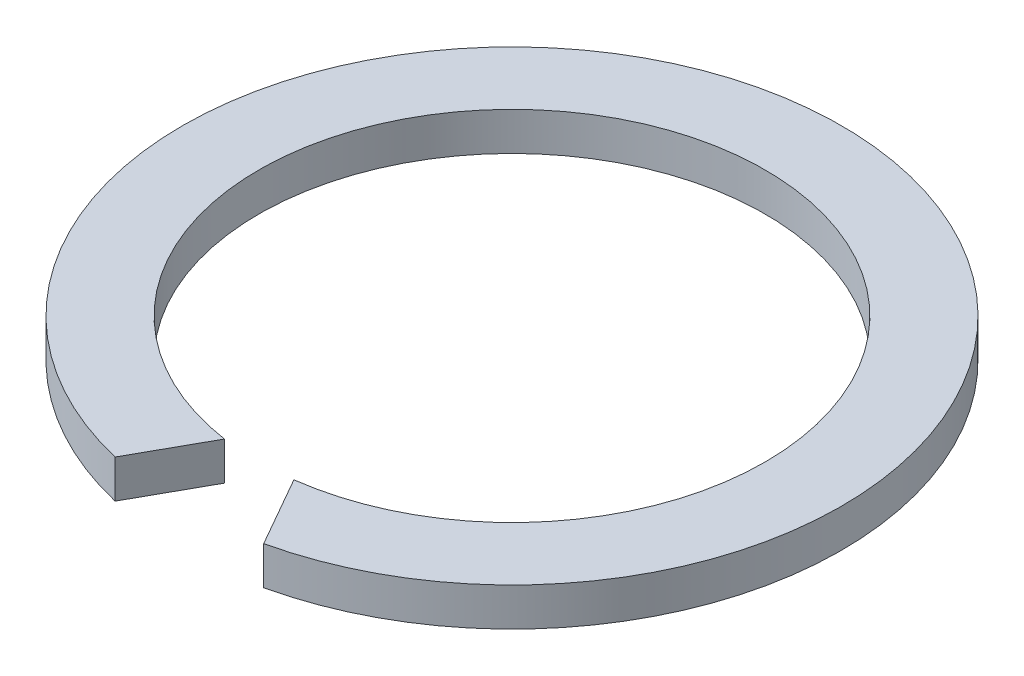
ISO-10303-21;
HEADER;
FILE_DESCRIPTION(('STEP AP214'),'2;1');
FILE_NAME('part.step','',(''),(''),'','','');
FILE_SCHEMA(('AUTOMOTIVE_DESIGN { 1 0 10303 214 1 1 1 1 }'));
ENDSEC;
DATA;
#1=APPLICATION_CONTEXT('core data for automotive mechanical design processes');
#2=APPLICATION_PROTOCOL_DEFINITION('international standard','automotive_design',2000,#1);
#3=PRODUCT_CONTEXT('',#1,'mechanical');
#4=PRODUCT('Part','Part','',(#3));
#5=PRODUCT_RELATED_PRODUCT_CATEGORY('part','',(#4));
#6=PRODUCT_DEFINITION_FORMATION('','',#4);
#7=PRODUCT_DEFINITION_CONTEXT('part definition',#1,'design');
#8=PRODUCT_DEFINITION('design','',#6,#7);
#9=PRODUCT_DEFINITION_SHAPE('','',#8);
#10=(LENGTH_UNIT() NAMED_UNIT(*) SI_UNIT(.MILLI.,.METRE.));
#11=(NAMED_UNIT(*) PLANE_ANGLE_UNIT() SI_UNIT($,.RADIAN.));
#12=(NAMED_UNIT(*) SI_UNIT($,.STERADIAN.) SOLID_ANGLE_UNIT());
#13=UNCERTAINTY_MEASURE_WITH_UNIT(LENGTH_MEASURE(1.E-05),#10,'distance_accuracy_value','');
#14=(GEOMETRIC_REPRESENTATION_CONTEXT(3) GLOBAL_UNCERTAINTY_ASSIGNED_CONTEXT((#13)) GLOBAL_UNIT_ASSIGNED_CONTEXT((#10,
#11,#12)) REPRESENTATION_CONTEXT('',''));
#15=CARTESIAN_POINT('',(0.,0.,0.));
#16=DIRECTION('',(0.,0.,1.));
#17=DIRECTION('',(1.,0.,0.));
#18=AXIS2_PLACEMENT_3D('',#15,#16,#17);
#19=CARTESIAN_POINT('',(0.,2.5,0.));
#20=DIRECTION('',(0.,1.,0.));
#21=DIRECTION('',(0.,0.,1.));
#22=AXIS2_PLACEMENT_3D('',#19,#20,#21);
#23=PLANE('',#22);
#24=CARTESIAN_POINT('',(0.,2.5,0.));
#25=DIRECTION('',(0.,1.,0.));
#26=DIRECTION('',(0.,0.,1.));
#27=AXIS2_PLACEMENT_3D('',#24,#25,#26);
#28=CIRCLE('',#27,21.55);
#29=CARTESIAN_POINT('',(4.77677147901234,2.5,21.0139228664544));
#30=VERTEX_POINT('',#29);
#31=CARTESIAN_POINT('',(-4.98672506362487,2.5,20.9650917751346));
#32=VERTEX_POINT('',#31);
#33=EDGE_CURVE('E84',#30,#32,#28,.T.);
#34=ORIENTED_EDGE('',*,*,#33,.T.);
#35=DIRECTION('',(0.485886601891455,0.,-0.87402185905295));
#36=VECTOR('',#35,1.);
#37=CARTESIAN_POINT('',(5.09393092634377,2.5,2.83182023702798));
#38=LINE('',#37,#36);
#39=CARTESIAN_POINT('',(-2.43237508740514,2.5,16.3702795160672));
#40=VERTEX_POINT('',#39);
#41=EDGE_CURVE('E98',#32,#40,#38,.T.);
#42=ORIENTED_EDGE('',*,*,#41,.T.);
#43=CARTESIAN_POINT('',(0.,2.5,0.));
#44=DIRECTION('',(0.,1.,0.));
#45=DIRECTION('',(0.,0.,1.));
#46=AXIS2_PLACEMENT_3D('',#43,#44,#45);
#47=CIRCLE('',#46,16.55);
#48=CARTESIAN_POINT('',(2.14851773111688,2.5,16.4099473356582));
#49=VERTEX_POINT('',#48);
#50=EDGE_CURVE('E94',#49,#40,#47,.T.);
#51=ORIENTED_EDGE('',*,*,#50,.F.);
#52=DIRECTION('',(0.495770682094167,0.,0.868453470702884));
#53=VECTOR('',#52,1.);
#54=CARTESIAN_POINT('',(-5.44492805124509,2.5,3.10832506862417));
#55=LINE('',#54,#53);
#56=EDGE_CURVE('E61',#49,#30,#55,.T.);
#57=ORIENTED_EDGE('',*,*,#56,.T.);
#58=EDGE_LOOP('',(#34,#42,#51,#57));
#59=FACE_BOUND('',#58,.T.);
#60=ADVANCED_FACE('F39',(#59),#23,.T.);
#61=CARTESIAN_POINT('',(0.,0.,0.));
#62=DIRECTION('',(0.,1.,0.));
#63=DIRECTION('',(0.,0.,1.));
#64=AXIS2_PLACEMENT_3D('',#61,#62,#63);
#65=PLANE('',#64);
#66=DIRECTION('',(0.485886601891455,0.,-0.87402185905295));
#67=VECTOR('',#66,1.);
#68=CARTESIAN_POINT('',(5.09393092634377,0.,2.83182023702798));
#69=LINE('',#68,#67);
#70=CARTESIAN_POINT('',(-4.98672506362487,0.,20.9650917751346));
#71=VERTEX_POINT('',#70);
#72=CARTESIAN_POINT('',(-2.43237508740514,0.,16.3702795160672));
#73=VERTEX_POINT('',#72);
#74=EDGE_CURVE('E54',#71,#73,#69,.T.);
#75=ORIENTED_EDGE('',*,*,#74,.F.);
#76=CARTESIAN_POINT('',(0.,0.,0.));
#77=DIRECTION('',(0.,1.,0.));
#78=DIRECTION('',(0.,0.,1.));
#79=AXIS2_PLACEMENT_3D('',#76,#77,#78);
#80=CIRCLE('',#79,21.55);
#81=CARTESIAN_POINT('',(4.77677147901234,0.,21.0139228664544));
#82=VERTEX_POINT('',#81);
#83=EDGE_CURVE('E91',#82,#71,#80,.T.);
#84=ORIENTED_EDGE('',*,*,#83,.F.);
#85=DIRECTION('',(0.495770682094167,0.,0.868453470702884));
#86=VECTOR('',#85,1.);
#87=CARTESIAN_POINT('',(-5.44492805124509,0.,3.10832506862417));
#88=LINE('',#87,#86);
#89=CARTESIAN_POINT('',(2.14851773111688,0.,16.4099473356582));
#90=VERTEX_POINT('',#89);
#91=EDGE_CURVE('E78',#90,#82,#88,.T.);
#92=ORIENTED_EDGE('',*,*,#91,.F.);
#93=CARTESIAN_POINT('',(0.,0.,0.));
#94=DIRECTION('',(0.,1.,0.));
#95=DIRECTION('',(0.,0.,1.));
#96=AXIS2_PLACEMENT_3D('',#93,#94,#95);
#97=CIRCLE('',#96,16.55);
#98=EDGE_CURVE('E89',#90,#73,#97,.T.);
#99=ORIENTED_EDGE('',*,*,#98,.T.);
#100=EDGE_LOOP('',(#75,#84,#92,#99));
#101=FACE_BOUND('',#100,.T.);
#102=ADVANCED_FACE('F88',(#101),#65,.F.);
#103=CARTESIAN_POINT('',(0.,2.5,0.));
#104=DIRECTION('',(0.,-1.,0.));
#105=DIRECTION('',(0.,0.,-1.));
#106=AXIS2_PLACEMENT_3D('',#103,#104,#105);
#107=CYLINDRICAL_SURFACE('',#106,21.55);
#108=DIRECTION('',(0.,-1.,0.));
#109=VECTOR('',#108,1.);
#110=CARTESIAN_POINT('',(-4.98672506362487,2.5,20.9650917751346));
#111=LINE('',#110,#109);
#112=EDGE_CURVE('E95',#32,#71,#111,.T.);
#113=ORIENTED_EDGE('',*,*,#112,.F.);
#114=ORIENTED_EDGE('',*,*,#33,.F.);
#115=DIRECTION('',(0.,-1.,0.));
#116=VECTOR('',#115,1.);
#117=CARTESIAN_POINT('',(4.77677147901234,2.5,21.0139228664544));
#118=LINE('',#117,#116);
#119=EDGE_CURVE('E106',#82,#30,#118,.F.);
#120=ORIENTED_EDGE('',*,*,#119,.F.);
#121=ORIENTED_EDGE('',*,*,#83,.T.);
#122=EDGE_LOOP('',(#113,#114,#120,#121));
#123=FACE_BOUND('',#122,.T.);
#124=ADVANCED_FACE('F41',(#123),#107,.T.);
#125=CARTESIAN_POINT('',(0.,2.5,0.));
#126=DIRECTION('',(0.,-1.,0.));
#127=DIRECTION('',(0.,0.,-1.));
#128=AXIS2_PLACEMENT_3D('',#125,#126,#127);
#129=CYLINDRICAL_SURFACE('',#128,16.55);
#130=ORIENTED_EDGE('',*,*,#50,.T.);
#131=DIRECTION('',(0.,-1.,0.));
#132=VECTOR('',#131,1.);
#133=CARTESIAN_POINT('',(-2.43237508740514,2.5,16.3702795160672));
#134=LINE('',#133,#132);
#135=EDGE_CURVE('E11',#40,#73,#134,.T.);
#136=ORIENTED_EDGE('',*,*,#135,.T.);
#137=ORIENTED_EDGE('',*,*,#98,.F.);
#138=DIRECTION('',(0.,-1.,0.));
#139=VECTOR('',#138,1.);
#140=CARTESIAN_POINT('',(2.14851773111688,2.5,16.4099473356582));
#141=LINE('',#140,#139);
#142=EDGE_CURVE('E47',#90,#49,#141,.F.);
#143=ORIENTED_EDGE('',*,*,#142,.T.);
#144=EDGE_LOOP('',(#130,#136,#137,#143));
#145=FACE_BOUND('',#144,.T.);
#146=ADVANCED_FACE('F93',(#145),#129,.F.);
#147=CARTESIAN_POINT('',(1.70764609530707,15.,15.637661849481));
#148=DIRECTION('',(-0.868453470702884,0.,0.495770682094167));
#149=DIRECTION('',(0.495770682094167,0.,0.868453470702884));
#150=AXIS2_PLACEMENT_3D('',#147,#148,#149);
#151=PLANE('',#150);
#152=ORIENTED_EDGE('',*,*,#119,.T.);
#153=ORIENTED_EDGE('',*,*,#56,.F.);
#154=ORIENTED_EDGE('',*,*,#142,.F.);
#155=ORIENTED_EDGE('',*,*,#91,.T.);
#156=EDGE_LOOP('',(#152,#153,#154,#155));
#157=FACE_BOUND('',#156,.T.);
#158=ADVANCED_FACE('F77',(#157),#151,.T.);
#159=CARTESIAN_POINT('',(-6.05202906662891,15.,22.8813804349527));
#160=DIRECTION('',(0.87402185905295,0.,0.485886601891455));
#161=DIRECTION('',(0.485886601891455,0.,-0.87402185905295));
#162=AXIS2_PLACEMENT_3D('',#159,#160,#161);
#163=PLANE('',#162);
#164=ORIENTED_EDGE('',*,*,#112,.T.);
#165=ORIENTED_EDGE('',*,*,#74,.T.);
#166=ORIENTED_EDGE('',*,*,#135,.F.);
#167=ORIENTED_EDGE('',*,*,#41,.F.);
#168=EDGE_LOOP('',(#164,#165,#166,#167));
#169=FACE_BOUND('',#168,.T.);
#170=ADVANCED_FACE('F113',(#169),#163,.T.);
#171=CLOSED_SHELL('',(#60,#102,#124,#146,#158,#170));
#172=MANIFOLD_SOLID_BREP('B2',#171);
#173=ADVANCED_BREP_SHAPE_REPRESENTATION('',(#18,#172),#14);
#174=SHAPE_DEFINITION_REPRESENTATION(#9,#173);
ENDSEC;
END-ISO-10303-21;
